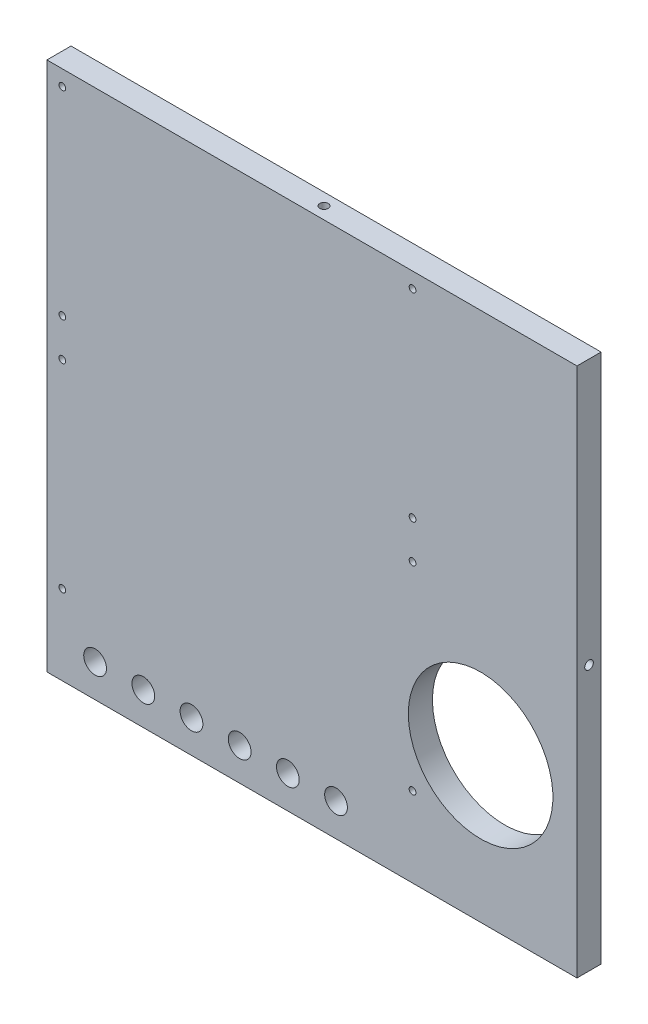
ISO-10303-21;
HEADER;
FILE_DESCRIPTION(('STEP AP214'),'2;1');
FILE_NAME('part.step','',(''),(''),'','','');
FILE_SCHEMA(('AUTOMOTIVE_DESIGN { 1 0 10303 214 1 1 1 1 }'));
ENDSEC;
DATA;
#1=APPLICATION_CONTEXT('core data for automotive mechanical design processes');
#2=APPLICATION_PROTOCOL_DEFINITION('international standard','automotive_design',2000,#1);
#3=PRODUCT_CONTEXT('',#1,'mechanical');
#4=PRODUCT('Part','Part','',(#3));
#5=PRODUCT_RELATED_PRODUCT_CATEGORY('part','',(#4));
#6=PRODUCT_DEFINITION_FORMATION('','',#4);
#7=PRODUCT_DEFINITION_CONTEXT('part definition',#1,'design');
#8=PRODUCT_DEFINITION('design','',#6,#7);
#9=PRODUCT_DEFINITION_SHAPE('','',#8);
#10=(LENGTH_UNIT() NAMED_UNIT(*) SI_UNIT(.MILLI.,.METRE.));
#11=(NAMED_UNIT(*) PLANE_ANGLE_UNIT() SI_UNIT($,.RADIAN.));
#12=(NAMED_UNIT(*) SI_UNIT($,.STERADIAN.) SOLID_ANGLE_UNIT());
#13=UNCERTAINTY_MEASURE_WITH_UNIT(LENGTH_MEASURE(1.E-05),#10,'distance_accuracy_value','');
#14=(GEOMETRIC_REPRESENTATION_CONTEXT(3) GLOBAL_UNCERTAINTY_ASSIGNED_CONTEXT((#13)) GLOBAL_UNIT_ASSIGNED_CONTEXT((#10,
#11,#12)) REPRESENTATION_CONTEXT('',''));
#15=CARTESIAN_POINT('',(0.,0.,0.));
#16=DIRECTION('',(0.,0.,1.));
#17=DIRECTION('',(1.,0.,0.));
#18=AXIS2_PLACEMENT_3D('',#15,#16,#17);
#19=CARTESIAN_POINT('',(69.85,-69.85,6.35));
#20=DIRECTION('',(-1.,0.,0.));
#21=DIRECTION('',(0.,0.,1.));
#22=AXIS2_PLACEMENT_3D('',#19,#20,#21);
#23=PLANE('',#22);
#24=CARTESIAN_POINT('',(69.85,0.,3.175));
#25=DIRECTION('',(1.,0.,0.));
#26=DIRECTION('',(0.,0.,-1.));
#27=AXIS2_PLACEMENT_3D('',#24,#25,#26);
#28=CIRCLE('',#27,1.13029999999999);
#29=CARTESIAN_POINT('',(69.85,0.,2.04470000000001));
#30=VERTEX_POINT('',#29);
#31=EDGE_CURVE('E234',#30,#30,#28,.T.);
#32=ORIENTED_EDGE('',*,*,#31,.F.);
#33=EDGE_LOOP('',(#32));
#34=FACE_BOUND('',#33,.T.);
#35=DIRECTION('',(0.,1.,0.));
#36=VECTOR('',#35,1.);
#37=CARTESIAN_POINT('',(69.85,-69.85,0.));
#38=LINE('',#37,#36);
#39=CARTESIAN_POINT('',(69.85,-69.85,0.));
#40=VERTEX_POINT('',#39);
#41=CARTESIAN_POINT('',(69.85,69.85,0.));
#42=VERTEX_POINT('',#41);
#43=EDGE_CURVE('E246',#40,#42,#38,.T.);
#44=ORIENTED_EDGE('',*,*,#43,.T.);
#45=DIRECTION('',(0.,0.,-1.));
#46=VECTOR('',#45,1.);
#47=CARTESIAN_POINT('',(69.85,69.85,6.35));
#48=LINE('',#47,#46);
#49=CARTESIAN_POINT('',(69.85,69.85,6.35));
#50=VERTEX_POINT('',#49);
#51=EDGE_CURVE('E11',#50,#42,#48,.T.);
#52=ORIENTED_EDGE('',*,*,#51,.F.);
#53=DIRECTION('',(0.,1.,0.));
#54=VECTOR('',#53,1.);
#55=CARTESIAN_POINT('',(69.85,-69.85,6.35));
#56=LINE('',#55,#54);
#57=CARTESIAN_POINT('',(69.85,-69.85,6.35));
#58=VERTEX_POINT('',#57);
#59=EDGE_CURVE('E247',#58,#50,#56,.T.);
#60=ORIENTED_EDGE('',*,*,#59,.F.);
#61=DIRECTION('',(0.,0.,-1.));
#62=VECTOR('',#61,1.);
#63=CARTESIAN_POINT('',(69.85,-69.85,6.35));
#64=LINE('',#63,#62);
#65=EDGE_CURVE('E57',#58,#40,#64,.T.);
#66=ORIENTED_EDGE('',*,*,#65,.T.);
#67=EDGE_LOOP('',(#44,#52,#60,#66));
#68=FACE_BOUND('',#67,.T.);
#69=ADVANCED_FACE('F41',(#34,#68),#23,.F.);
#70=CARTESIAN_POINT('',(69.85,69.85,6.35));
#71=DIRECTION('',(0.,-1.,0.));
#72=DIRECTION('',(1.,0.,0.));
#73=AXIS2_PLACEMENT_3D('',#70,#71,#72);
#74=PLANE('',#73);
#75=CARTESIAN_POINT('',(0.,69.85,3.175));
#76=DIRECTION('',(0.,1.,0.));
#77=DIRECTION('',(0.,0.,1.));
#78=AXIS2_PLACEMENT_3D('',#75,#76,#77);
#79=CIRCLE('',#78,1.13029999999999);
#80=CARTESIAN_POINT('',(0.,69.85,4.30529999999999));
#81=VERTEX_POINT('',#80);
#82=EDGE_CURVE('E240',#81,#81,#79,.T.);
#83=ORIENTED_EDGE('',*,*,#82,.F.);
#84=EDGE_LOOP('',(#83));
#85=FACE_BOUND('',#84,.T.);
#86=DIRECTION('',(-1.,0.,0.));
#87=VECTOR('',#86,1.);
#88=CARTESIAN_POINT('',(69.85,69.85,0.));
#89=LINE('',#88,#87);
#90=CARTESIAN_POINT('',(-69.85,69.85,0.));
#91=VERTEX_POINT('',#90);
#92=EDGE_CURVE('E257',#42,#91,#89,.T.);
#93=ORIENTED_EDGE('',*,*,#92,.T.);
#94=DIRECTION('',(0.,0.,-1.));
#95=VECTOR('',#94,1.);
#96=CARTESIAN_POINT('',(-69.85,69.85,6.35));
#97=LINE('',#96,#95);
#98=CARTESIAN_POINT('',(-69.85,69.85,6.35));
#99=VERTEX_POINT('',#98);
#100=EDGE_CURVE('E49',#99,#91,#97,.T.);
#101=ORIENTED_EDGE('',*,*,#100,.F.);
#102=DIRECTION('',(-1.,0.,0.));
#103=VECTOR('',#102,1.);
#104=CARTESIAN_POINT('',(69.85,69.85,6.35));
#105=LINE('',#104,#103);
#106=EDGE_CURVE('E83',#50,#99,#105,.T.);
#107=ORIENTED_EDGE('',*,*,#106,.F.);
#108=ORIENTED_EDGE('',*,*,#51,.T.);
#109=EDGE_LOOP('',(#93,#101,#107,#108));
#110=FACE_BOUND('',#109,.T.);
#111=ADVANCED_FACE('F269',(#85,#110),#74,.F.);
#112=CARTESIAN_POINT('',(-69.85,-69.85,6.35));
#113=DIRECTION('',(-1.,0.,0.));
#114=DIRECTION('',(0.,0.,1.));
#115=AXIS2_PLACEMENT_3D('',#112,#113,#114);
#116=PLANE('',#115);
#117=CARTESIAN_POINT('',(-69.85,0.,3.175));
#118=DIRECTION('',(-1.,0.,0.));
#119=DIRECTION('',(0.,0.,1.));
#120=AXIS2_PLACEMENT_3D('',#117,#118,#119);
#121=CIRCLE('',#120,1.13029999999999);
#122=CARTESIAN_POINT('',(-69.85,0.,4.30529999999999));
#123=VERTEX_POINT('',#122);
#124=EDGE_CURVE('E220',#123,#123,#121,.T.);
#125=ORIENTED_EDGE('',*,*,#124,.F.);
#126=EDGE_LOOP('',(#125));
#127=FACE_BOUND('',#126,.T.);
#128=DIRECTION('',(0.,1.,0.));
#129=VECTOR('',#128,1.);
#130=CARTESIAN_POINT('',(-69.85,-69.85,0.));
#131=LINE('',#130,#129);
#132=CARTESIAN_POINT('',(-69.85,-69.85,0.));
#133=VERTEX_POINT('',#132);
#134=EDGE_CURVE('E260',#133,#91,#131,.T.);
#135=ORIENTED_EDGE('',*,*,#134,.F.);
#136=DIRECTION('',(0.,0.,-1.));
#137=VECTOR('',#136,1.);
#138=CARTESIAN_POINT('',(-69.85,-69.85,6.35));
#139=LINE('',#138,#137);
#140=CARTESIAN_POINT('',(-69.85,-69.85,6.35));
#141=VERTEX_POINT('',#140);
#142=EDGE_CURVE('E72',#141,#133,#139,.T.);
#143=ORIENTED_EDGE('',*,*,#142,.F.);
#144=DIRECTION('',(0.,1.,0.));
#145=VECTOR('',#144,1.);
#146=CARTESIAN_POINT('',(-69.85,-69.85,6.35));
#147=LINE('',#146,#145);
#148=EDGE_CURVE('E251',#141,#99,#147,.T.);
#149=ORIENTED_EDGE('',*,*,#148,.T.);
#150=ORIENTED_EDGE('',*,*,#100,.T.);
#151=EDGE_LOOP('',(#135,#143,#149,#150));
#152=FACE_BOUND('',#151,.T.);
#153=ADVANCED_FACE('F267',(#127,#152),#116,.T.);
#154=CARTESIAN_POINT('',(69.85,-69.85,6.35));
#155=DIRECTION('',(0.,-1.,0.));
#156=DIRECTION('',(1.,0.,0.));
#157=AXIS2_PLACEMENT_3D('',#154,#155,#156);
#158=PLANE('',#157);
#159=CARTESIAN_POINT('',(0.,-69.85,3.175));
#160=DIRECTION('',(0.,-1.,0.));
#161=DIRECTION('',(0.,0.,-1.));
#162=AXIS2_PLACEMENT_3D('',#159,#160,#161);
#163=CIRCLE('',#162,1.13029999999999);
#164=CARTESIAN_POINT('',(0.,-69.85,2.04470000000001));
#165=VERTEX_POINT('',#164);
#166=EDGE_CURVE('E228',#165,#165,#163,.T.);
#167=ORIENTED_EDGE('',*,*,#166,.F.);
#168=EDGE_LOOP('',(#167));
#169=FACE_BOUND('',#168,.T.);
#170=DIRECTION('',(-1.,0.,0.));
#171=VECTOR('',#170,1.);
#172=CARTESIAN_POINT('',(69.85,-69.85,0.));
#173=LINE('',#172,#171);
#174=EDGE_CURVE('E249',#40,#133,#173,.T.);
#175=ORIENTED_EDGE('',*,*,#174,.F.);
#176=ORIENTED_EDGE('',*,*,#65,.F.);
#177=DIRECTION('',(-1.,0.,0.));
#178=VECTOR('',#177,1.);
#179=CARTESIAN_POINT('',(69.85,-69.85,6.35));
#180=LINE('',#179,#178);
#181=EDGE_CURVE('E254',#58,#141,#180,.T.);
#182=ORIENTED_EDGE('',*,*,#181,.T.);
#183=ORIENTED_EDGE('',*,*,#142,.T.);
#184=EDGE_LOOP('',(#175,#176,#182,#183));
#185=FACE_BOUND('',#184,.T.);
#186=ADVANCED_FACE('F273',(#169,#185),#158,.T.);
#187=CARTESIAN_POINT('',(0.,0.,6.35));
#188=DIRECTION('',(0.,0.,1.));
#189=DIRECTION('',(1.,0.,0.));
#190=AXIS2_PLACEMENT_3D('',#187,#188,#189);
#191=PLANE('',#190);
#192=CARTESIAN_POINT('',(-57.15,-61.214,6.35));
#193=DIRECTION('',(0.,0.,1.));
#194=DIRECTION('',(1.,0.,0.));
#195=AXIS2_PLACEMENT_3D('',#192,#193,#194);
#196=CIRCLE('',#195,3.);
#197=CARTESIAN_POINT('',(-54.15,-61.214,6.35));
#198=VERTEX_POINT('',#197);
#199=EDGE_CURVE('E828',#198,#198,#196,.T.);
#200=ORIENTED_EDGE('',*,*,#199,.F.);
#201=EDGE_LOOP('',(#200));
#202=FACE_BOUND('',#201,.T.);
#203=CARTESIAN_POINT('',(-44.45,-61.214,6.35));
#204=DIRECTION('',(0.,0.,1.));
#205=DIRECTION('',(1.,0.,0.));
#206=AXIS2_PLACEMENT_3D('',#203,#204,#205);
#207=CIRCLE('',#206,3.);
#208=CARTESIAN_POINT('',(-41.45,-61.214,6.35));
#209=VERTEX_POINT('',#208);
#210=EDGE_CURVE('E830',#209,#209,#207,.T.);
#211=ORIENTED_EDGE('',*,*,#210,.F.);
#212=EDGE_LOOP('',(#211));
#213=FACE_BOUND('',#212,.T.);
#214=CARTESIAN_POINT('',(-31.75,-61.214,6.35));
#215=DIRECTION('',(0.,0.,1.));
#216=DIRECTION('',(1.,0.,0.));
#217=AXIS2_PLACEMENT_3D('',#214,#215,#216);
#218=CIRCLE('',#217,3.);
#219=CARTESIAN_POINT('',(-28.75,-61.214,6.35));
#220=VERTEX_POINT('',#219);
#221=EDGE_CURVE('E836',#220,#220,#218,.T.);
#222=ORIENTED_EDGE('',*,*,#221,.F.);
#223=EDGE_LOOP('',(#222));
#224=FACE_BOUND('',#223,.T.);
#225=CARTESIAN_POINT('',(-19.05,-61.214,6.35));
#226=DIRECTION('',(0.,0.,1.));
#227=DIRECTION('',(1.,0.,0.));
#228=AXIS2_PLACEMENT_3D('',#225,#226,#227);
#229=CIRCLE('',#228,3.);
#230=CARTESIAN_POINT('',(-16.05,-61.214,6.35));
#231=VERTEX_POINT('',#230);
#232=EDGE_CURVE('E840',#231,#231,#229,.T.);
#233=ORIENTED_EDGE('',*,*,#232,.F.);
#234=EDGE_LOOP('',(#233));
#235=FACE_BOUND('',#234,.T.);
#236=CARTESIAN_POINT('',(-6.35000000000002,-61.214,6.35));
#237=DIRECTION('',(0.,0.,1.));
#238=DIRECTION('',(1.,0.,0.));
#239=AXIS2_PLACEMENT_3D('',#236,#237,#238);
#240=CIRCLE('',#239,3.);
#241=CARTESIAN_POINT('',(-3.35000000000002,-61.214,6.35));
#242=VERTEX_POINT('',#241);
#243=EDGE_CURVE('E844',#242,#242,#240,.T.);
#244=ORIENTED_EDGE('',*,*,#243,.F.);
#245=EDGE_LOOP('',(#244));
#246=FACE_BOUND('',#245,.T.);
#247=CARTESIAN_POINT('',(6.34999999999998,-61.214,6.35));
#248=DIRECTION('',(0.,0.,1.));
#249=DIRECTION('',(1.,0.,0.));
#250=AXIS2_PLACEMENT_3D('',#247,#248,#249);
#251=CIRCLE('',#250,3.);
#252=CARTESIAN_POINT('',(9.34999999999998,-61.214,6.35));
#253=VERTEX_POINT('',#252);
#254=EDGE_CURVE('E848',#253,#253,#251,.T.);
#255=ORIENTED_EDGE('',*,*,#254,.F.);
#256=EDGE_LOOP('',(#255));
#257=FACE_BOUND('',#256,.T.);
#258=CARTESIAN_POINT('',(-65.786,65.786,6.35));
#259=DIRECTION('',(0.,0.,1.));
#260=DIRECTION('',(1.,0.,0.));
#261=AXIS2_PLACEMENT_3D('',#258,#259,#260);
#262=CIRCLE('',#261,0.889000000000001);
#263=CARTESIAN_POINT('',(-64.897,65.786,6.35));
#264=VERTEX_POINT('',#263);
#265=EDGE_CURVE('E168',#264,#264,#262,.T.);
#266=ORIENTED_EDGE('',*,*,#265,.F.);
#267=EDGE_LOOP('',(#266));
#268=FACE_BOUND('',#267,.T.);
#269=CARTESIAN_POINT('',(26.514,65.786,6.35));
#270=DIRECTION('',(0.,0.,1.));
#271=DIRECTION('',(1.,0.,0.));
#272=AXIS2_PLACEMENT_3D('',#269,#270,#271);
#273=CIRCLE('',#272,0.889000000000001);
#274=CARTESIAN_POINT('',(27.403,65.786,6.35));
#275=VERTEX_POINT('',#274);
#276=EDGE_CURVE('E174',#275,#275,#273,.T.);
#277=ORIENTED_EDGE('',*,*,#276,.F.);
#278=EDGE_LOOP('',(#277));
#279=FACE_BOUND('',#278,.T.);
#280=CARTESIAN_POINT('',(-65.786,13.486,6.35));
#281=DIRECTION('',(0.,0.,1.));
#282=DIRECTION('',(1.,0.,0.));
#283=AXIS2_PLACEMENT_3D('',#280,#281,#282);
#284=CIRCLE('',#283,0.889000000000001);
#285=CARTESIAN_POINT('',(-64.897,13.486,6.35));
#286=VERTEX_POINT('',#285);
#287=EDGE_CURVE('E180',#286,#286,#284,.T.);
#288=ORIENTED_EDGE('',*,*,#287,.F.);
#289=EDGE_LOOP('',(#288));
#290=FACE_BOUND('',#289,.T.);
#291=CARTESIAN_POINT('',(26.514,13.486,6.35));
#292=DIRECTION('',(0.,0.,1.));
#293=DIRECTION('',(1.,0.,0.));
#294=AXIS2_PLACEMENT_3D('',#291,#292,#293);
#295=CIRCLE('',#294,0.889000000000001);
#296=CARTESIAN_POINT('',(27.403,13.486,6.35));
#297=VERTEX_POINT('',#296);
#298=EDGE_CURVE('E186',#297,#297,#295,.T.);
#299=ORIENTED_EDGE('',*,*,#298,.F.);
#300=EDGE_LOOP('',(#299));
#301=FACE_BOUND('',#300,.T.);
#302=CARTESIAN_POINT('',(-65.786,3.486,6.35));
#303=DIRECTION('',(0.,0.,1.));
#304=DIRECTION('',(1.,0.,0.));
#305=AXIS2_PLACEMENT_3D('',#302,#303,#304);
#306=CIRCLE('',#305,0.889000000000001);
#307=CARTESIAN_POINT('',(-64.897,3.486,6.35));
#308=VERTEX_POINT('',#307);
#309=EDGE_CURVE('E192',#308,#308,#306,.T.);
#310=ORIENTED_EDGE('',*,*,#309,.F.);
#311=EDGE_LOOP('',(#310));
#312=FACE_BOUND('',#311,.T.);
#313=CARTESIAN_POINT('',(26.514,3.48600000000001,6.35));
#314=DIRECTION('',(0.,0.,1.));
#315=DIRECTION('',(1.,0.,0.));
#316=AXIS2_PLACEMENT_3D('',#313,#314,#315);
#317=CIRCLE('',#316,0.888999999999997);
#318=CARTESIAN_POINT('',(27.403,3.48600000000001,6.35));
#319=VERTEX_POINT('',#318);
#320=EDGE_CURVE('E198',#319,#319,#317,.T.);
#321=ORIENTED_EDGE('',*,*,#320,.F.);
#322=EDGE_LOOP('',(#321));
#323=FACE_BOUND('',#322,.T.);
#324=CARTESIAN_POINT('',(-65.786,-48.814,6.35));
#325=DIRECTION('',(0.,0.,1.));
#326=DIRECTION('',(1.,0.,0.));
#327=AXIS2_PLACEMENT_3D('',#324,#325,#326);
#328=CIRCLE('',#327,0.889000000000001);
#329=CARTESIAN_POINT('',(-64.897,-48.814,6.35));
#330=VERTEX_POINT('',#329);
#331=EDGE_CURVE('E204',#330,#330,#328,.T.);
#332=ORIENTED_EDGE('',*,*,#331,.F.);
#333=EDGE_LOOP('',(#332));
#334=FACE_BOUND('',#333,.T.);
#335=CARTESIAN_POINT('',(26.514,-48.814,6.35));
#336=DIRECTION('',(0.,0.,1.));
#337=DIRECTION('',(1.,0.,0.));
#338=AXIS2_PLACEMENT_3D('',#335,#336,#337);
#339=CIRCLE('',#338,0.889000000000001);
#340=CARTESIAN_POINT('',(27.403,-48.814,6.35));
#341=VERTEX_POINT('',#340);
#342=EDGE_CURVE('E210',#341,#341,#339,.T.);
#343=ORIENTED_EDGE('',*,*,#342,.F.);
#344=EDGE_LOOP('',(#343));
#345=FACE_BOUND('',#344,.T.);
#346=CARTESIAN_POINT('',(44.45,-31.75,6.35));
#347=DIRECTION('',(0.,0.,-1.));
#348=DIRECTION('',(-1.,0.,0.));
#349=AXIS2_PLACEMENT_3D('',#346,#347,#348);
#350=CIRCLE('',#349,19.05);
#351=CARTESIAN_POINT('',(25.4,-31.75,6.35));
#352=VERTEX_POINT('',#351);
#353=EDGE_CURVE('E217',#352,#352,#350,.T.);
#354=ORIENTED_EDGE('',*,*,#353,.T.);
#355=EDGE_LOOP('',(#354));
#356=FACE_BOUND('',#355,.T.);
#357=ORIENTED_EDGE('',*,*,#59,.T.);
#358=ORIENTED_EDGE('',*,*,#106,.T.);
#359=ORIENTED_EDGE('',*,*,#148,.F.);
#360=ORIENTED_EDGE('',*,*,#181,.F.);
#361=EDGE_LOOP('',(#357,#358,#359,#360));
#362=FACE_BOUND('',#361,.T.);
#363=ADVANCED_FACE('F275',(#202,#213,#224,#235,#246,#257,#268,#279,#290,#301,#312,#323,#334,
#345,#356,#362),#191,.T.);
#364=CARTESIAN_POINT('',(0.,0.,0.));
#365=DIRECTION('',(0.,0.,1.));
#366=DIRECTION('',(1.,0.,0.));
#367=AXIS2_PLACEMENT_3D('',#364,#365,#366);
#368=PLANE('',#367);
#369=CARTESIAN_POINT('',(-57.15,-61.214,0.));
#370=DIRECTION('',(0.,0.,1.));
#371=DIRECTION('',(1.,0.,0.));
#372=AXIS2_PLACEMENT_3D('',#369,#370,#371);
#373=CIRCLE('',#372,3.);
#374=CARTESIAN_POINT('',(-54.15,-61.214,0.));
#375=VERTEX_POINT('',#374);
#376=EDGE_CURVE('E330',#375,#375,#373,.T.);
#377=ORIENTED_EDGE('',*,*,#376,.T.);
#378=EDGE_LOOP('',(#377));
#379=FACE_BOUND('',#378,.T.);
#380=CARTESIAN_POINT('',(-44.45,-61.214,0.));
#381=DIRECTION('',(0.,0.,1.));
#382=DIRECTION('',(1.,0.,0.));
#383=AXIS2_PLACEMENT_3D('',#380,#381,#382);
#384=CIRCLE('',#383,3.);
#385=CARTESIAN_POINT('',(-41.45,-61.214,0.));
#386=VERTEX_POINT('',#385);
#387=EDGE_CURVE('E334',#386,#386,#384,.T.);
#388=ORIENTED_EDGE('',*,*,#387,.T.);
#389=EDGE_LOOP('',(#388));
#390=FACE_BOUND('',#389,.T.);
#391=CARTESIAN_POINT('',(-31.75,-61.214,0.));
#392=DIRECTION('',(0.,0.,1.));
#393=DIRECTION('',(1.,0.,0.));
#394=AXIS2_PLACEMENT_3D('',#391,#392,#393);
#395=CIRCLE('',#394,3.);
#396=CARTESIAN_POINT('',(-28.75,-61.214,0.));
#397=VERTEX_POINT('',#396);
#398=EDGE_CURVE('E338',#397,#397,#395,.T.);
#399=ORIENTED_EDGE('',*,*,#398,.T.);
#400=EDGE_LOOP('',(#399));
#401=FACE_BOUND('',#400,.T.);
#402=CARTESIAN_POINT('',(-19.05,-61.214,0.));
#403=DIRECTION('',(0.,0.,1.));
#404=DIRECTION('',(1.,0.,0.));
#405=AXIS2_PLACEMENT_3D('',#402,#403,#404);
#406=CIRCLE('',#405,3.);
#407=CARTESIAN_POINT('',(-16.05,-61.214,0.));
#408=VERTEX_POINT('',#407);
#409=EDGE_CURVE('E342',#408,#408,#406,.T.);
#410=ORIENTED_EDGE('',*,*,#409,.T.);
#411=EDGE_LOOP('',(#410));
#412=FACE_BOUND('',#411,.T.);
#413=CARTESIAN_POINT('',(-6.35000000000002,-61.214,0.));
#414=DIRECTION('',(0.,0.,1.));
#415=DIRECTION('',(1.,0.,0.));
#416=AXIS2_PLACEMENT_3D('',#413,#414,#415);
#417=CIRCLE('',#416,3.);
#418=CARTESIAN_POINT('',(-3.35000000000002,-61.214,0.));
#419=VERTEX_POINT('',#418);
#420=EDGE_CURVE('E346',#419,#419,#417,.T.);
#421=ORIENTED_EDGE('',*,*,#420,.T.);
#422=EDGE_LOOP('',(#421));
#423=FACE_BOUND('',#422,.T.);
#424=CARTESIAN_POINT('',(6.34999999999998,-61.214,0.));
#425=DIRECTION('',(0.,0.,1.));
#426=DIRECTION('',(1.,0.,0.));
#427=AXIS2_PLACEMENT_3D('',#424,#425,#426);
#428=CIRCLE('',#427,3.);
#429=CARTESIAN_POINT('',(9.34999999999998,-61.214,0.));
#430=VERTEX_POINT('',#429);
#431=EDGE_CURVE('E150',#430,#430,#428,.T.);
#432=ORIENTED_EDGE('',*,*,#431,.T.);
#433=EDGE_LOOP('',(#432));
#434=FACE_BOUND('',#433,.T.);
#435=CARTESIAN_POINT('',(-44.45,44.45,0.));
#436=DIRECTION('',(0.,0.,-1.));
#437=DIRECTION('',(-1.,0.,0.));
#438=AXIS2_PLACEMENT_3D('',#435,#436,#437);
#439=CIRCLE('',#438,0.888999999999987);
#440=CARTESIAN_POINT('',(-45.339,44.45,0.));
#441=VERTEX_POINT('',#440);
#442=EDGE_CURVE('E144',#441,#441,#439,.T.);
#443=ORIENTED_EDGE('',*,*,#442,.F.);
#444=EDGE_LOOP('',(#443));
#445=FACE_BOUND('',#444,.T.);
#446=CARTESIAN_POINT('',(-44.45,-24.13,0.));
#447=DIRECTION('',(0.,0.,-1.));
#448=DIRECTION('',(-1.,0.,0.));
#449=AXIS2_PLACEMENT_3D('',#446,#447,#448);
#450=CIRCLE('',#449,0.888999999999987);
#451=CARTESIAN_POINT('',(-45.339,-24.13,0.));
#452=VERTEX_POINT('',#451);
#453=EDGE_CURVE('E143',#452,#452,#450,.T.);
#454=ORIENTED_EDGE('',*,*,#453,.F.);
#455=EDGE_LOOP('',(#454));
#456=FACE_BOUND('',#455,.T.);
#457=CARTESIAN_POINT('',(24.13,-24.13,0.));
#458=DIRECTION('',(0.,0.,-1.));
#459=DIRECTION('',(-1.,0.,0.));
#460=AXIS2_PLACEMENT_3D('',#457,#458,#459);
#461=CIRCLE('',#460,0.88899999999999);
#462=CARTESIAN_POINT('',(23.241,-24.13,0.));
#463=VERTEX_POINT('',#462);
#464=EDGE_CURVE('E156',#463,#463,#461,.T.);
#465=ORIENTED_EDGE('',*,*,#464,.F.);
#466=EDGE_LOOP('',(#465));
#467=FACE_BOUND('',#466,.T.);
#468=CARTESIAN_POINT('',(24.13,44.4500000000001,0.));
#469=DIRECTION('',(0.,0.,-1.));
#470=DIRECTION('',(-1.,0.,0.));
#471=AXIS2_PLACEMENT_3D('',#468,#469,#470);
#472=CIRCLE('',#471,0.888999999999987);
#473=CARTESIAN_POINT('',(23.241,44.4500000000001,0.));
#474=VERTEX_POINT('',#473);
#475=EDGE_CURVE('E162',#474,#474,#472,.T.);
#476=ORIENTED_EDGE('',*,*,#475,.F.);
#477=EDGE_LOOP('',(#476));
#478=FACE_BOUND('',#477,.T.);
#479=CARTESIAN_POINT('',(44.45,-31.75,0.));
#480=DIRECTION('',(0.,0.,-1.));
#481=DIRECTION('',(-1.,0.,0.));
#482=AXIS2_PLACEMENT_3D('',#479,#480,#481);
#483=CIRCLE('',#482,19.05);
#484=CARTESIAN_POINT('',(25.4,-31.75,0.));
#485=VERTEX_POINT('',#484);
#486=EDGE_CURVE('E216',#485,#485,#483,.T.);
#487=ORIENTED_EDGE('',*,*,#486,.F.);
#488=EDGE_LOOP('',(#487));
#489=FACE_BOUND('',#488,.T.);
#490=ORIENTED_EDGE('',*,*,#43,.F.);
#491=ORIENTED_EDGE('',*,*,#174,.T.);
#492=ORIENTED_EDGE('',*,*,#134,.T.);
#493=ORIENTED_EDGE('',*,*,#92,.F.);
#494=EDGE_LOOP('',(#490,#491,#492,#493));
#495=FACE_BOUND('',#494,.T.);
#496=ADVANCED_FACE('F272',(#379,#390,#401,#412,#423,#434,#445,#456,#467,#478,#489,#495),#368,.F.);
#497=CARTESIAN_POINT('',(0.,62.2554,3.175));
#498=DIRECTION('',(0.,1.,0.));
#499=DIRECTION('',(0.,0.,1.));
#500=AXIS2_PLACEMENT_3D('',#497,#498,#499);
#501=CONICAL_SURFACE('',#500,1.13029999999999,1.02974425867665);
#502=CARTESIAN_POINT('',(0.,61.5762472423131,3.175));
#503=VERTEX_POINT('',#502);
#504=VERTEX_LOOP('',#503);
#505=FACE_BOUND('',#504,.T.);
#506=CARTESIAN_POINT('',(0.,62.2554,3.175));
#507=DIRECTION('',(0.,1.,0.));
#508=DIRECTION('',(0.,0.,1.));
#509=AXIS2_PLACEMENT_3D('',#506,#507,#508);
#510=CIRCLE('',#509,1.13029999999999);
#511=CARTESIAN_POINT('',(0.,62.2554,4.30529999999999));
#512=VERTEX_POINT('',#511);
#513=EDGE_CURVE('E243',#512,#512,#510,.T.);
#514=ORIENTED_EDGE('',*,*,#513,.T.);
#515=EDGE_LOOP('',(#514));
#516=FACE_BOUND('',#515,.T.);
#517=ADVANCED_FACE('F319',(#505,#516),#501,.F.);
#518=CARTESIAN_POINT('',(0.,69.85,3.175));
#519=DIRECTION('',(0.,1.,0.));
#520=DIRECTION('',(0.,0.,1.));
#521=AXIS2_PLACEMENT_3D('',#518,#519,#520);
#522=CYLINDRICAL_SURFACE('',#521,1.13029999999999);
#523=ORIENTED_EDGE('',*,*,#513,.F.);
#524=EDGE_LOOP('',(#523));
#525=FACE_BOUND('',#524,.T.);
#526=ORIENTED_EDGE('',*,*,#82,.T.);
#527=EDGE_LOOP('',(#526));
#528=FACE_BOUND('',#527,.T.);
#529=ADVANCED_FACE('F311',(#525,#528),#522,.F.);
#530=CARTESIAN_POINT('',(62.2554,0.,3.175));
#531=DIRECTION('',(1.,0.,0.));
#532=DIRECTION('',(0.,0.,-1.));
#533=AXIS2_PLACEMENT_3D('',#530,#531,#532);
#534=CONICAL_SURFACE('',#533,1.13029999999999,1.02974425867665);
#535=CARTESIAN_POINT('',(61.5762472423131,0.,3.175));
#536=VERTEX_POINT('',#535);
#537=VERTEX_LOOP('',#536);
#538=FACE_BOUND('',#537,.T.);
#539=CARTESIAN_POINT('',(62.2554,0.,3.175));
#540=DIRECTION('',(1.,0.,0.));
#541=DIRECTION('',(0.,0.,-1.));
#542=AXIS2_PLACEMENT_3D('',#539,#540,#541);
#543=CIRCLE('',#542,1.13029999999999);
#544=CARTESIAN_POINT('',(62.2554,0.,2.04470000000001));
#545=VERTEX_POINT('',#544);
#546=EDGE_CURVE('E237',#545,#545,#543,.T.);
#547=ORIENTED_EDGE('',*,*,#546,.T.);
#548=EDGE_LOOP('',(#547));
#549=FACE_BOUND('',#548,.T.);
#550=ADVANCED_FACE('F301',(#538,#549),#534,.F.);
#551=CARTESIAN_POINT('',(69.85,0.,3.175));
#552=DIRECTION('',(1.,0.,0.));
#553=DIRECTION('',(0.,0.,-1.));
#554=AXIS2_PLACEMENT_3D('',#551,#552,#553);
#555=CYLINDRICAL_SURFACE('',#554,1.13029999999999);
#556=ORIENTED_EDGE('',*,*,#546,.F.);
#557=EDGE_LOOP('',(#556));
#558=FACE_BOUND('',#557,.T.);
#559=ORIENTED_EDGE('',*,*,#31,.T.);
#560=EDGE_LOOP('',(#559));
#561=FACE_BOUND('',#560,.T.);
#562=ADVANCED_FACE('F298',(#558,#561),#555,.F.);
#563=CARTESIAN_POINT('',(0.,-62.2554,3.175));
#564=DIRECTION('',(0.,-1.,0.));
#565=DIRECTION('',(0.,0.,-1.));
#566=AXIS2_PLACEMENT_3D('',#563,#564,#565);
#567=CONICAL_SURFACE('',#566,1.13029999999999,1.02974425867665);
#568=CARTESIAN_POINT('',(0.,-61.5762472423132,3.175));
#569=VERTEX_POINT('',#568);
#570=VERTEX_LOOP('',#569);
#571=FACE_BOUND('',#570,.T.);
#572=CARTESIAN_POINT('',(0.,-62.2554,3.175));
#573=DIRECTION('',(0.,-1.,0.));
#574=DIRECTION('',(0.,0.,-1.));
#575=AXIS2_PLACEMENT_3D('',#572,#573,#574);
#576=CIRCLE('',#575,1.13029999999999);
#577=CARTESIAN_POINT('',(0.,-62.2554,2.04470000000001));
#578=VERTEX_POINT('',#577);
#579=EDGE_CURVE('E231',#578,#578,#576,.T.);
#580=ORIENTED_EDGE('',*,*,#579,.T.);
#581=EDGE_LOOP('',(#580));
#582=FACE_BOUND('',#581,.T.);
#583=ADVANCED_FACE('F300',(#571,#582),#567,.F.);
#584=CARTESIAN_POINT('',(0.,-69.85,3.175));
#585=DIRECTION('',(0.,-1.,0.));
#586=DIRECTION('',(0.,0.,-1.));
#587=AXIS2_PLACEMENT_3D('',#584,#585,#586);
#588=CYLINDRICAL_SURFACE('',#587,1.13029999999999);
#589=ORIENTED_EDGE('',*,*,#579,.F.);
#590=EDGE_LOOP('',(#589));
#591=FACE_BOUND('',#590,.T.);
#592=ORIENTED_EDGE('',*,*,#166,.T.);
#593=EDGE_LOOP('',(#592));
#594=FACE_BOUND('',#593,.T.);
#595=ADVANCED_FACE('F308',(#591,#594),#588,.F.);
#596=CARTESIAN_POINT('',(-62.2554,0.,3.175));
#597=DIRECTION('',(-1.,0.,0.));
#598=DIRECTION('',(0.,0.,1.));
#599=AXIS2_PLACEMENT_3D('',#596,#597,#598);
#600=CONICAL_SURFACE('',#599,1.13029999999999,1.02974425867665);
#601=CARTESIAN_POINT('',(-61.5762472423132,0.,3.175));
#602=VERTEX_POINT('',#601);
#603=VERTEX_LOOP('',#602);
#604=FACE_BOUND('',#603,.T.);
#605=CARTESIAN_POINT('',(-62.2554,0.,3.175));
#606=DIRECTION('',(-1.,0.,0.));
#607=DIRECTION('',(0.,0.,1.));
#608=AXIS2_PLACEMENT_3D('',#605,#606,#607);
#609=CIRCLE('',#608,1.13029999999999);
#610=CARTESIAN_POINT('',(-62.2554,0.,4.30529999999999));
#611=VERTEX_POINT('',#610);
#612=EDGE_CURVE('E225',#611,#611,#609,.T.);
#613=ORIENTED_EDGE('',*,*,#612,.T.);
#614=EDGE_LOOP('',(#613));
#615=FACE_BOUND('',#614,.T.);
#616=ADVANCED_FACE('F373',(#604,#615),#600,.F.);
#617=CARTESIAN_POINT('',(-69.85,0.,3.175));
#618=DIRECTION('',(-1.,0.,0.));
#619=DIRECTION('',(0.,0.,1.));
#620=AXIS2_PLACEMENT_3D('',#617,#618,#619);
#621=CYLINDRICAL_SURFACE('',#620,1.13029999999999);
#622=ORIENTED_EDGE('',*,*,#612,.F.);
#623=EDGE_LOOP('',(#622));
#624=FACE_BOUND('',#623,.T.);
#625=ORIENTED_EDGE('',*,*,#124,.T.);
#626=EDGE_LOOP('',(#625));
#627=FACE_BOUND('',#626,.T.);
#628=ADVANCED_FACE('F363',(#624,#627),#621,.F.);
#629=CARTESIAN_POINT('',(44.45,-31.75,6.35));
#630=DIRECTION('',(0.,0.,-1.));
#631=DIRECTION('',(-1.,0.,0.));
#632=AXIS2_PLACEMENT_3D('',#629,#630,#631);
#633=CYLINDRICAL_SURFACE('',#632,19.05);
#634=ORIENTED_EDGE('',*,*,#353,.F.);
#635=EDGE_LOOP('',(#634));
#636=FACE_BOUND('',#635,.T.);
#637=ORIENTED_EDGE('',*,*,#486,.T.);
#638=EDGE_LOOP('',(#637));
#639=FACE_BOUND('',#638,.T.);
#640=ADVANCED_FACE('F360',(#636,#639),#633,.F.);
#641=CARTESIAN_POINT('',(26.514,-48.814,0.6096));
#642=DIRECTION('',(0.,0.,1.));
#643=DIRECTION('',(1.,0.,0.));
#644=AXIS2_PLACEMENT_3D('',#641,#642,#643);
#645=CONICAL_SURFACE('',#644,0.888999999999997,1.02974425867665);
#646=CARTESIAN_POINT('',(26.514,-48.814,0.0754349096844997));
#647=VERTEX_POINT('',#646);
#648=VERTEX_LOOP('',#647);
#649=FACE_BOUND('',#648,.T.);
#650=CARTESIAN_POINT('',(26.514,-48.814,0.6096));
#651=DIRECTION('',(0.,0.,1.));
#652=DIRECTION('',(1.,0.,0.));
#653=AXIS2_PLACEMENT_3D('',#650,#651,#652);
#654=CIRCLE('',#653,0.888999999999997);
#655=CARTESIAN_POINT('',(27.403,-48.814,0.6096));
#656=VERTEX_POINT('',#655);
#657=EDGE_CURVE('E213',#656,#656,#654,.T.);
#658=ORIENTED_EDGE('',*,*,#657,.T.);
#659=EDGE_LOOP('',(#658));
#660=FACE_BOUND('',#659,.T.);
#661=ADVANCED_FACE('F362',(#649,#660),#645,.F.);
#662=CARTESIAN_POINT('',(26.514,-48.814,6.35));
#663=DIRECTION('',(0.,0.,1.));
#664=DIRECTION('',(1.,0.,0.));
#665=AXIS2_PLACEMENT_3D('',#662,#663,#664);
#666=CYLINDRICAL_SURFACE('',#665,0.888999999999999);
#667=ORIENTED_EDGE('',*,*,#657,.F.);
#668=EDGE_LOOP('',(#667));
#669=FACE_BOUND('',#668,.T.);
#670=ORIENTED_EDGE('',*,*,#342,.T.);
#671=EDGE_LOOP('',(#670));
#672=FACE_BOUND('',#671,.T.);
#673=ADVANCED_FACE('F370',(#669,#672),#666,.F.);
#674=CARTESIAN_POINT('',(-65.786,-48.814,0.6096));
#675=DIRECTION('',(0.,0.,1.));
#676=DIRECTION('',(1.,0.,0.));
#677=AXIS2_PLACEMENT_3D('',#674,#675,#676);
#678=CONICAL_SURFACE('',#677,0.889000000000001,1.02974425867666);
#679=CARTESIAN_POINT('',(-65.786,-48.814,0.0754349096844997));
#680=VERTEX_POINT('',#679);
#681=VERTEX_LOOP('',#680);
#682=FACE_BOUND('',#681,.T.);
#683=CARTESIAN_POINT('',(-65.786,-48.814,0.6096));
#684=DIRECTION('',(0.,0.,1.));
#685=DIRECTION('',(1.,0.,0.));
#686=AXIS2_PLACEMENT_3D('',#683,#684,#685);
#687=CIRCLE('',#686,0.889000000000001);
#688=CARTESIAN_POINT('',(-64.897,-48.814,0.6096));
#689=VERTEX_POINT('',#688);
#690=EDGE_CURVE('E207',#689,#689,#687,.T.);
#691=ORIENTED_EDGE('',*,*,#690,.T.);
#692=EDGE_LOOP('',(#691));
#693=FACE_BOUND('',#692,.T.);
#694=ADVANCED_FACE('F490',(#682,#693),#678,.F.);
#695=CARTESIAN_POINT('',(-65.786,-48.814,6.35));
#696=DIRECTION('',(0.,0.,1.));
#697=DIRECTION('',(1.,0.,0.));
#698=AXIS2_PLACEMENT_3D('',#695,#696,#697);
#699=CYLINDRICAL_SURFACE('',#698,0.889000000000001);
#700=ORIENTED_EDGE('',*,*,#690,.F.);
#701=EDGE_LOOP('',(#700));
#702=FACE_BOUND('',#701,.T.);
#703=ORIENTED_EDGE('',*,*,#331,.T.);
#704=EDGE_LOOP('',(#703));
#705=FACE_BOUND('',#704,.T.);
#706=ADVANCED_FACE('F485',(#702,#705),#699,.F.);
#707=CARTESIAN_POINT('',(26.514,3.48600000000001,0.6096));
#708=DIRECTION('',(0.,0.,1.));
#709=DIRECTION('',(1.,0.,0.));
#710=AXIS2_PLACEMENT_3D('',#707,#708,#709);
#711=CONICAL_SURFACE('',#710,0.888999999999997,1.02974425867665);
#712=CARTESIAN_POINT('',(26.514,3.48600000000001,0.0754349096844997));
#713=VERTEX_POINT('',#712);
#714=VERTEX_LOOP('',#713);
#715=FACE_BOUND('',#714,.T.);
#716=CARTESIAN_POINT('',(26.514,3.48600000000001,0.6096));
#717=DIRECTION('',(0.,0.,1.));
#718=DIRECTION('',(1.,0.,0.));
#719=AXIS2_PLACEMENT_3D('',#716,#717,#718);
#720=CIRCLE('',#719,0.888999999999997);
#721=CARTESIAN_POINT('',(27.403,3.48600000000001,0.6096));
#722=VERTEX_POINT('',#721);
#723=EDGE_CURVE('E201',#722,#722,#720,.T.);
#724=ORIENTED_EDGE('',*,*,#723,.T.);
#725=EDGE_LOOP('',(#724));
#726=FACE_BOUND('',#725,.T.);
#727=ADVANCED_FACE('F477',(#715,#726),#711,.F.);
#728=CARTESIAN_POINT('',(26.514,3.48600000000001,6.35));
#729=DIRECTION('',(0.,0.,1.));
#730=DIRECTION('',(1.,0.,0.));
#731=AXIS2_PLACEMENT_3D('',#728,#729,#730);
#732=CYLINDRICAL_SURFACE('',#731,0.888999999999997);
#733=ORIENTED_EDGE('',*,*,#723,.F.);
#734=EDGE_LOOP('',(#733));
#735=FACE_BOUND('',#734,.T.);
#736=ORIENTED_EDGE('',*,*,#320,.T.);
#737=EDGE_LOOP('',(#736));
#738=FACE_BOUND('',#737,.T.);
#739=ADVANCED_FACE('F472',(#735,#738),#732,.F.);
#740=CARTESIAN_POINT('',(-65.786,3.486,0.6096));
#741=DIRECTION('',(0.,0.,1.));
#742=DIRECTION('',(1.,0.,0.));
#743=AXIS2_PLACEMENT_3D('',#740,#741,#742);
#744=CONICAL_SURFACE('',#743,0.889000000000001,1.02974425867666);
#745=CARTESIAN_POINT('',(-65.786,3.486,0.0754349096844997));
#746=VERTEX_POINT('',#745);
#747=VERTEX_LOOP('',#746);
#748=FACE_BOUND('',#747,.T.);
#749=CARTESIAN_POINT('',(-65.786,3.486,0.6096));
#750=DIRECTION('',(0.,0.,1.));
#751=DIRECTION('',(1.,0.,0.));
#752=AXIS2_PLACEMENT_3D('',#749,#750,#751);
#753=CIRCLE('',#752,0.889000000000001);
#754=CARTESIAN_POINT('',(-64.897,3.486,0.6096));
#755=VERTEX_POINT('',#754);
#756=EDGE_CURVE('E195',#755,#755,#753,.T.);
#757=ORIENTED_EDGE('',*,*,#756,.T.);
#758=EDGE_LOOP('',(#757));
#759=FACE_BOUND('',#758,.T.);
#760=ADVANCED_FACE('F464',(#748,#759),#744,.F.);
#761=CARTESIAN_POINT('',(-65.786,3.486,6.35));
#762=DIRECTION('',(0.,0.,1.));
#763=DIRECTION('',(1.,0.,0.));
#764=AXIS2_PLACEMENT_3D('',#761,#762,#763);
#765=CYLINDRICAL_SURFACE('',#764,0.889000000000001);
#766=ORIENTED_EDGE('',*,*,#756,.F.);
#767=EDGE_LOOP('',(#766));
#768=FACE_BOUND('',#767,.T.);
#769=ORIENTED_EDGE('',*,*,#309,.T.);
#770=EDGE_LOOP('',(#769));
#771=FACE_BOUND('',#770,.T.);
#772=ADVANCED_FACE('F459',(#768,#771),#765,.F.);
#773=CARTESIAN_POINT('',(26.514,13.486,0.6096));
#774=DIRECTION('',(0.,0.,1.));
#775=DIRECTION('',(1.,0.,0.));
#776=AXIS2_PLACEMENT_3D('',#773,#774,#775);
#777=CONICAL_SURFACE('',#776,0.888999999999997,1.02974425867665);
#778=CARTESIAN_POINT('',(26.514,13.486,0.0754349096844997));
#779=VERTEX_POINT('',#778);
#780=VERTEX_LOOP('',#779);
#781=FACE_BOUND('',#780,.T.);
#782=CARTESIAN_POINT('',(26.514,13.486,0.6096));
#783=DIRECTION('',(0.,0.,1.));
#784=DIRECTION('',(1.,0.,0.));
#785=AXIS2_PLACEMENT_3D('',#782,#783,#784);
#786=CIRCLE('',#785,0.888999999999997);
#787=CARTESIAN_POINT('',(27.403,13.486,0.6096));
#788=VERTEX_POINT('',#787);
#789=EDGE_CURVE('E189',#788,#788,#786,.T.);
#790=ORIENTED_EDGE('',*,*,#789,.T.);
#791=EDGE_LOOP('',(#790));
#792=FACE_BOUND('',#791,.T.);
#793=ADVANCED_FACE('F451',(#781,#792),#777,.F.);
#794=CARTESIAN_POINT('',(26.514,13.486,6.35));
#795=DIRECTION('',(0.,0.,1.));
#796=DIRECTION('',(1.,0.,0.));
#797=AXIS2_PLACEMENT_3D('',#794,#795,#796);
#798=CYLINDRICAL_SURFACE('',#797,0.888999999999999);
#799=ORIENTED_EDGE('',*,*,#789,.F.);
#800=EDGE_LOOP('',(#799));
#801=FACE_BOUND('',#800,.T.);
#802=ORIENTED_EDGE('',*,*,#298,.T.);
#803=EDGE_LOOP('',(#802));
#804=FACE_BOUND('',#803,.T.);
#805=ADVANCED_FACE('F446',(#801,#804),#798,.F.);
#806=CARTESIAN_POINT('',(-65.786,13.486,0.6096));
#807=DIRECTION('',(0.,0.,1.));
#808=DIRECTION('',(1.,0.,0.));
#809=AXIS2_PLACEMENT_3D('',#806,#807,#808);
#810=CONICAL_SURFACE('',#809,0.889000000000001,1.02974425867666);
#811=CARTESIAN_POINT('',(-65.786,13.486,0.0754349096844997));
#812=VERTEX_POINT('',#811);
#813=VERTEX_LOOP('',#812);
#814=FACE_BOUND('',#813,.T.);
#815=CARTESIAN_POINT('',(-65.786,13.486,0.6096));
#816=DIRECTION('',(0.,0.,1.));
#817=DIRECTION('',(1.,0.,0.));
#818=AXIS2_PLACEMENT_3D('',#815,#816,#817);
#819=CIRCLE('',#818,0.889000000000001);
#820=CARTESIAN_POINT('',(-64.897,13.486,0.6096));
#821=VERTEX_POINT('',#820);
#822=EDGE_CURVE('E183',#821,#821,#819,.T.);
#823=ORIENTED_EDGE('',*,*,#822,.T.);
#824=EDGE_LOOP('',(#823));
#825=FACE_BOUND('',#824,.T.);
#826=ADVANCED_FACE('F438',(#814,#825),#810,.F.);
#827=CARTESIAN_POINT('',(-65.786,13.486,6.35));
#828=DIRECTION('',(0.,0.,1.));
#829=DIRECTION('',(1.,0.,0.));
#830=AXIS2_PLACEMENT_3D('',#827,#828,#829);
#831=CYLINDRICAL_SURFACE('',#830,0.889000000000001);
#832=ORIENTED_EDGE('',*,*,#822,.F.);
#833=EDGE_LOOP('',(#832));
#834=FACE_BOUND('',#833,.T.);
#835=ORIENTED_EDGE('',*,*,#287,.T.);
#836=EDGE_LOOP('',(#835));
#837=FACE_BOUND('',#836,.T.);
#838=ADVANCED_FACE('F433',(#834,#837),#831,.F.);
#839=CARTESIAN_POINT('',(26.514,65.786,0.6096));
#840=DIRECTION('',(0.,0.,1.));
#841=DIRECTION('',(1.,0.,0.));
#842=AXIS2_PLACEMENT_3D('',#839,#840,#841);
#843=CONICAL_SURFACE('',#842,0.888999999999997,1.02974425867665);
#844=CARTESIAN_POINT('',(26.514,65.786,0.0754349096844997));
#845=VERTEX_POINT('',#844);
#846=VERTEX_LOOP('',#845);
#847=FACE_BOUND('',#846,.T.);
#848=CARTESIAN_POINT('',(26.514,65.786,0.6096));
#849=DIRECTION('',(0.,0.,1.));
#850=DIRECTION('',(1.,0.,0.));
#851=AXIS2_PLACEMENT_3D('',#848,#849,#850);
#852=CIRCLE('',#851,0.888999999999997);
#853=CARTESIAN_POINT('',(27.403,65.786,0.6096));
#854=VERTEX_POINT('',#853);
#855=EDGE_CURVE('E177',#854,#854,#852,.T.);
#856=ORIENTED_EDGE('',*,*,#855,.T.);
#857=EDGE_LOOP('',(#856));
#858=FACE_BOUND('',#857,.T.);
#859=ADVANCED_FACE('F425',(#847,#858),#843,.F.);
#860=CARTESIAN_POINT('',(26.514,65.786,6.35));
#861=DIRECTION('',(0.,0.,1.));
#862=DIRECTION('',(1.,0.,0.));
#863=AXIS2_PLACEMENT_3D('',#860,#861,#862);
#864=CYLINDRICAL_SURFACE('',#863,0.888999999999999);
#865=ORIENTED_EDGE('',*,*,#855,.F.);
#866=EDGE_LOOP('',(#865));
#867=FACE_BOUND('',#866,.T.);
#868=ORIENTED_EDGE('',*,*,#276,.T.);
#869=EDGE_LOOP('',(#868));
#870=FACE_BOUND('',#869,.T.);
#871=ADVANCED_FACE('F420',(#867,#870),#864,.F.);
#872=CARTESIAN_POINT('',(-65.786,65.786,0.6096));
#873=DIRECTION('',(0.,0.,1.));
#874=DIRECTION('',(1.,0.,0.));
#875=AXIS2_PLACEMENT_3D('',#872,#873,#874);
#876=CONICAL_SURFACE('',#875,0.889000000000001,1.02974425867666);
#877=CARTESIAN_POINT('',(-65.786,65.786,0.0754349096844997));
#878=VERTEX_POINT('',#877);
#879=VERTEX_LOOP('',#878);
#880=FACE_BOUND('',#879,.T.);
#881=CARTESIAN_POINT('',(-65.786,65.786,0.6096));
#882=DIRECTION('',(0.,0.,1.));
#883=DIRECTION('',(1.,0.,0.));
#884=AXIS2_PLACEMENT_3D('',#881,#882,#883);
#885=CIRCLE('',#884,0.889000000000001);
#886=CARTESIAN_POINT('',(-64.897,65.786,0.6096));
#887=VERTEX_POINT('',#886);
#888=EDGE_CURVE('E171',#887,#887,#885,.T.);
#889=ORIENTED_EDGE('',*,*,#888,.T.);
#890=EDGE_LOOP('',(#889));
#891=FACE_BOUND('',#890,.T.);
#892=ADVANCED_FACE('F410',(#880,#891),#876,.F.);
#893=CARTESIAN_POINT('',(-65.786,65.786,6.35));
#894=DIRECTION('',(0.,0.,1.));
#895=DIRECTION('',(1.,0.,0.));
#896=AXIS2_PLACEMENT_3D('',#893,#894,#895);
#897=CYLINDRICAL_SURFACE('',#896,0.889000000000001);
#898=ORIENTED_EDGE('',*,*,#888,.F.);
#899=EDGE_LOOP('',(#898));
#900=FACE_BOUND('',#899,.T.);
#901=ORIENTED_EDGE('',*,*,#265,.T.);
#902=EDGE_LOOP('',(#901));
#903=FACE_BOUND('',#902,.T.);
#904=ADVANCED_FACE('F404',(#900,#903),#897,.F.);
#905=CARTESIAN_POINT('',(24.13,44.4500000000001,5.74039999999999));
#906=DIRECTION('',(0.,0.,-1.));
#907=DIRECTION('',(-1.,0.,0.));
#908=AXIS2_PLACEMENT_3D('',#905,#906,#907);
#909=CONICAL_SURFACE('',#908,0.888999999999987,1.02974425867665);
#910=CARTESIAN_POINT('',(24.13,44.4500000000001,6.27456509031549));
#911=VERTEX_POINT('',#910);
#912=VERTEX_LOOP('',#911);
#913=FACE_BOUND('',#912,.T.);
#914=CARTESIAN_POINT('',(24.13,44.4500000000001,5.74039999999999));
#915=DIRECTION('',(0.,0.,-1.));
#916=DIRECTION('',(-1.,0.,0.));
#917=AXIS2_PLACEMENT_3D('',#914,#915,#916);
#918=CIRCLE('',#917,0.888999999999987);
#919=CARTESIAN_POINT('',(23.241,44.4500000000001,5.74039999999999));
#920=VERTEX_POINT('',#919);
#921=EDGE_CURVE('E165',#920,#920,#918,.T.);
#922=ORIENTED_EDGE('',*,*,#921,.T.);
#923=EDGE_LOOP('',(#922));
#924=FACE_BOUND('',#923,.T.);
#925=ADVANCED_FACE('F409',(#913,#924),#909,.F.);
#926=CARTESIAN_POINT('',(24.13,44.4500000000001,0.));
#927=DIRECTION('',(0.,0.,-1.));
#928=DIRECTION('',(-1.,0.,0.));
#929=AXIS2_PLACEMENT_3D('',#926,#927,#928);
#930=CYLINDRICAL_SURFACE('',#929,0.888999999999987);
#931=ORIENTED_EDGE('',*,*,#921,.F.);
#932=EDGE_LOOP('',(#931));
#933=FACE_BOUND('',#932,.T.);
#934=ORIENTED_EDGE('',*,*,#475,.T.);
#935=EDGE_LOOP('',(#934));
#936=FACE_BOUND('',#935,.T.);
#937=ADVANCED_FACE('F544',(#933,#936),#930,.F.);
#938=CARTESIAN_POINT('',(24.13,-24.13,5.74039999999999));
#939=DIRECTION('',(0.,0.,-1.));
#940=DIRECTION('',(-1.,0.,0.));
#941=AXIS2_PLACEMENT_3D('',#938,#939,#940);
#942=CONICAL_SURFACE('',#941,0.888999999999987,1.02974425867665);
#943=CARTESIAN_POINT('',(24.13,-24.13,6.27456509031549));
#944=VERTEX_POINT('',#943);
#945=VERTEX_LOOP('',#944);
#946=FACE_BOUND('',#945,.T.);
#947=CARTESIAN_POINT('',(24.13,-24.13,5.74039999999999));
#948=DIRECTION('',(0.,0.,-1.));
#949=DIRECTION('',(-1.,0.,0.));
#950=AXIS2_PLACEMENT_3D('',#947,#948,#949);
#951=CIRCLE('',#950,0.888999999999987);
#952=CARTESIAN_POINT('',(23.241,-24.13,5.74039999999999));
#953=VERTEX_POINT('',#952);
#954=EDGE_CURVE('E159',#953,#953,#951,.T.);
#955=ORIENTED_EDGE('',*,*,#954,.T.);
#956=EDGE_LOOP('',(#955));
#957=FACE_BOUND('',#956,.T.);
#958=ADVANCED_FACE('F536',(#946,#957),#942,.F.);
#959=CARTESIAN_POINT('',(24.13,-24.13,0.));
#960=DIRECTION('',(0.,0.,-1.));
#961=DIRECTION('',(-1.,0.,0.));
#962=AXIS2_PLACEMENT_3D('',#959,#960,#961);
#963=CYLINDRICAL_SURFACE('',#962,0.888999999999989);
#964=ORIENTED_EDGE('',*,*,#954,.F.);
#965=EDGE_LOOP('',(#964));
#966=FACE_BOUND('',#965,.T.);
#967=ORIENTED_EDGE('',*,*,#464,.T.);
#968=EDGE_LOOP('',(#967));
#969=FACE_BOUND('',#968,.T.);
#970=ADVANCED_FACE('F531',(#966,#969),#963,.F.);
#971=CARTESIAN_POINT('',(-44.45,-24.13,5.74039999999999));
#972=DIRECTION('',(0.,0.,-1.));
#973=DIRECTION('',(-1.,0.,0.));
#974=AXIS2_PLACEMENT_3D('',#971,#972,#973);
#975=CONICAL_SURFACE('',#974,0.888999999999987,1.02974425867665);
#976=CARTESIAN_POINT('',(-44.45,-24.13,6.27456509031549));
#977=VERTEX_POINT('',#976);
#978=VERTEX_LOOP('',#977);
#979=FACE_BOUND('',#978,.T.);
#980=CARTESIAN_POINT('',(-44.45,-24.13,5.74039999999999));
#981=DIRECTION('',(0.,0.,-1.));
#982=DIRECTION('',(-1.,0.,0.));
#983=AXIS2_PLACEMENT_3D('',#980,#981,#982);
#984=CIRCLE('',#983,0.888999999999987);
#985=CARTESIAN_POINT('',(-45.339,-24.13,5.74039999999999));
#986=VERTEX_POINT('',#985);
#987=EDGE_CURVE('E147',#986,#986,#984,.T.);
#988=ORIENTED_EDGE('',*,*,#987,.T.);
#989=EDGE_LOOP('',(#988));
#990=FACE_BOUND('',#989,.T.);
#991=ADVANCED_FACE('F523',(#979,#990),#975,.F.);
#992=CARTESIAN_POINT('',(-44.45,-24.13,0.));
#993=DIRECTION('',(0.,0.,-1.));
#994=DIRECTION('',(-1.,0.,0.));
#995=AXIS2_PLACEMENT_3D('',#992,#993,#994);
#996=CYLINDRICAL_SURFACE('',#995,0.888999999999987);
#997=ORIENTED_EDGE('',*,*,#987,.F.);
#998=EDGE_LOOP('',(#997));
#999=FACE_BOUND('',#998,.T.);
#1000=ORIENTED_EDGE('',*,*,#453,.T.);
#1001=EDGE_LOOP('',(#1000));
#1002=FACE_BOUND('',#1001,.T.);
#1003=ADVANCED_FACE('F137',(#999,#1002),#996,.F.);
#1004=CARTESIAN_POINT('',(-44.45,44.45,5.74039999999999));
#1005=DIRECTION('',(0.,0.,-1.));
#1006=DIRECTION('',(-1.,0.,0.));
#1007=AXIS2_PLACEMENT_3D('',#1004,#1005,#1006);
#1008=CONICAL_SURFACE('',#1007,0.888999999999987,1.02974425867665);
#1009=CARTESIAN_POINT('',(-44.45,44.45,6.27456509031549));
#1010=VERTEX_POINT('',#1009);
#1011=VERTEX_LOOP('',#1010);
#1012=FACE_BOUND('',#1011,.T.);
#1013=CARTESIAN_POINT('',(-44.45,44.45,5.74039999999999));
#1014=DIRECTION('',(0.,0.,-1.));
#1015=DIRECTION('',(-1.,0.,0.));
#1016=AXIS2_PLACEMENT_3D('',#1013,#1014,#1015);
#1017=CIRCLE('',#1016,0.888999999999987);
#1018=CARTESIAN_POINT('',(-45.339,44.45,5.74039999999999));
#1019=VERTEX_POINT('',#1018);
#1020=EDGE_CURVE('E141',#1019,#1019,#1017,.T.);
#1021=ORIENTED_EDGE('',*,*,#1020,.T.);
#1022=EDGE_LOOP('',(#1021));
#1023=FACE_BOUND('',#1022,.T.);
#1024=ADVANCED_FACE('F133',(#1012,#1023),#1008,.F.);
#1025=CARTESIAN_POINT('',(-44.45,44.45,0.));
#1026=DIRECTION('',(0.,0.,-1.));
#1027=DIRECTION('',(-1.,0.,0.));
#1028=AXIS2_PLACEMENT_3D('',#1025,#1026,#1027);
#1029=CYLINDRICAL_SURFACE('',#1028,0.888999999999987);
#1030=ORIENTED_EDGE('',*,*,#1020,.F.);
#1031=EDGE_LOOP('',(#1030));
#1032=FACE_BOUND('',#1031,.T.);
#1033=ORIENTED_EDGE('',*,*,#442,.T.);
#1034=EDGE_LOOP('',(#1033));
#1035=FACE_BOUND('',#1034,.T.);
#1036=ADVANCED_FACE('F136',(#1032,#1035),#1029,.F.);
#1037=CARTESIAN_POINT('',(6.34999999999998,-61.214,6.35));
#1038=DIRECTION('',(0.,0.,1.));
#1039=DIRECTION('',(1.,0.,0.));
#1040=AXIS2_PLACEMENT_3D('',#1037,#1038,#1039);
#1041=CYLINDRICAL_SURFACE('',#1040,3.);
#1042=ORIENTED_EDGE('',*,*,#431,.F.);
#1043=EDGE_LOOP('',(#1042));
#1044=FACE_BOUND('',#1043,.T.);
#1045=ORIENTED_EDGE('',*,*,#254,.T.);
#1046=EDGE_LOOP('',(#1045));
#1047=FACE_BOUND('',#1046,.T.);
#1048=ADVANCED_FACE('F511',(#1044,#1047),#1041,.F.);
#1049=CARTESIAN_POINT('',(-6.35000000000002,-61.214,6.35));
#1050=DIRECTION('',(0.,0.,1.));
#1051=DIRECTION('',(1.,0.,0.));
#1052=AXIS2_PLACEMENT_3D('',#1049,#1050,#1051);
#1053=CYLINDRICAL_SURFACE('',#1052,3.);
#1054=ORIENTED_EDGE('',*,*,#420,.F.);
#1055=EDGE_LOOP('',(#1054));
#1056=FACE_BOUND('',#1055,.T.);
#1057=ORIENTED_EDGE('',*,*,#243,.T.);
#1058=EDGE_LOOP('',(#1057));
#1059=FACE_BOUND('',#1058,.T.);
#1060=ADVANCED_FACE('F585',(#1056,#1059),#1053,.F.);
#1061=CARTESIAN_POINT('',(-19.05,-61.214,6.35));
#1062=DIRECTION('',(0.,0.,1.));
#1063=DIRECTION('',(1.,0.,0.));
#1064=AXIS2_PLACEMENT_3D('',#1061,#1062,#1063);
#1065=CYLINDRICAL_SURFACE('',#1064,3.);
#1066=ORIENTED_EDGE('',*,*,#409,.F.);
#1067=EDGE_LOOP('',(#1066));
#1068=FACE_BOUND('',#1067,.T.);
#1069=ORIENTED_EDGE('',*,*,#232,.T.);
#1070=EDGE_LOOP('',(#1069));
#1071=FACE_BOUND('',#1070,.T.);
#1072=ADVANCED_FACE('F594',(#1068,#1071),#1065,.F.);
#1073=CARTESIAN_POINT('',(-31.75,-61.214,6.35));
#1074=DIRECTION('',(0.,0.,1.));
#1075=DIRECTION('',(1.,0.,0.));
#1076=AXIS2_PLACEMENT_3D('',#1073,#1074,#1075);
#1077=CYLINDRICAL_SURFACE('',#1076,3.);
#1078=ORIENTED_EDGE('',*,*,#398,.F.);
#1079=EDGE_LOOP('',(#1078));
#1080=FACE_BOUND('',#1079,.T.);
#1081=ORIENTED_EDGE('',*,*,#221,.T.);
#1082=EDGE_LOOP('',(#1081));
#1083=FACE_BOUND('',#1082,.T.);
#1084=ADVANCED_FACE('F603',(#1080,#1083),#1077,.F.);
#1085=CARTESIAN_POINT('',(-44.45,-61.214,6.35));
#1086=DIRECTION('',(0.,0.,1.));
#1087=DIRECTION('',(1.,0.,0.));
#1088=AXIS2_PLACEMENT_3D('',#1085,#1086,#1087);
#1089=CYLINDRICAL_SURFACE('',#1088,3.);
#1090=ORIENTED_EDGE('',*,*,#387,.F.);
#1091=EDGE_LOOP('',(#1090));
#1092=FACE_BOUND('',#1091,.T.);
#1093=ORIENTED_EDGE('',*,*,#210,.T.);
#1094=EDGE_LOOP('',(#1093));
#1095=FACE_BOUND('',#1094,.T.);
#1096=ADVANCED_FACE('F612',(#1092,#1095),#1089,.F.);
#1097=CARTESIAN_POINT('',(-57.15,-61.214,6.35));
#1098=DIRECTION('',(0.,0.,1.));
#1099=DIRECTION('',(1.,0.,0.));
#1100=AXIS2_PLACEMENT_3D('',#1097,#1098,#1099);
#1101=CYLINDRICAL_SURFACE('',#1100,3.);
#1102=ORIENTED_EDGE('',*,*,#376,.F.);
#1103=EDGE_LOOP('',(#1102));
#1104=FACE_BOUND('',#1103,.T.);
#1105=ORIENTED_EDGE('',*,*,#199,.T.);
#1106=EDGE_LOOP('',(#1105));
#1107=FACE_BOUND('',#1106,.T.);
#1108=ADVANCED_FACE('F621',(#1104,#1107),#1101,.F.);
#1109=CLOSED_SHELL('',(#69,#111,#153,#186,#363,#496,#517,#529,#550,#562,#583,#595,#616,#628,
#640,#661,#673,#694,#706,#727,#739,#760,#772,#793,#805,#826,#838,#859,#871,#892,#904,#925,#937,
#958,#970,#991,#1003,#1024,#1036,#1048,#1060,#1072,#1084,#1096,#1108));
#1110=MANIFOLD_SOLID_BREP('B2',#1109);
#1111=ADVANCED_BREP_SHAPE_REPRESENTATION('',(#18,#1110),#14);
#1112=SHAPE_DEFINITION_REPRESENTATION(#9,#1111);
ENDSEC;
END-ISO-10303-21;
